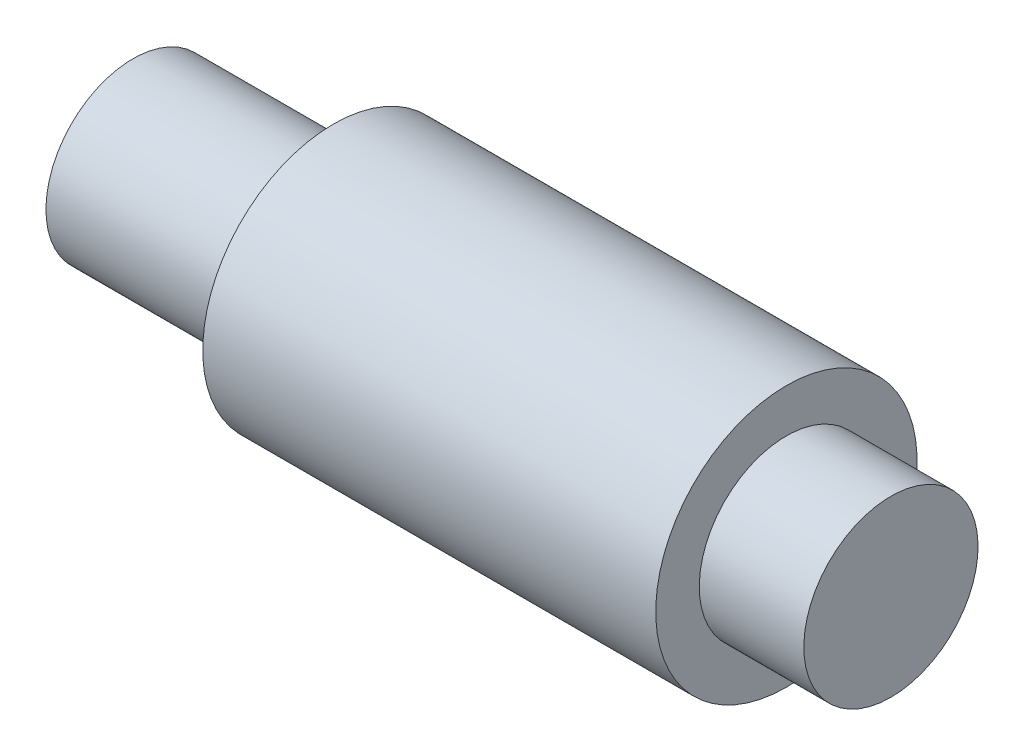
ISO-10303-21;
HEADER;
FILE_DESCRIPTION(('STEP AP214'),'2;1');
FILE_NAME('part.step','',(''),(''),'','','');
FILE_SCHEMA(('AUTOMOTIVE_DESIGN { 1 0 10303 214 1 1 1 1 }'));
ENDSEC;
DATA;
#1=APPLICATION_CONTEXT('core data for automotive mechanical design processes');
#2=APPLICATION_PROTOCOL_DEFINITION('international standard','automotive_design',2000,#1);
#3=PRODUCT_CONTEXT('',#1,'mechanical');
#4=PRODUCT('Part','Part','',(#3));
#5=PRODUCT_RELATED_PRODUCT_CATEGORY('part','',(#4));
#6=PRODUCT_DEFINITION_FORMATION('','',#4);
#7=PRODUCT_DEFINITION_CONTEXT('part definition',#1,'design');
#8=PRODUCT_DEFINITION('design','',#6,#7);
#9=PRODUCT_DEFINITION_SHAPE('','',#8);
#10=(LENGTH_UNIT() NAMED_UNIT(*) SI_UNIT(.MILLI.,.METRE.));
#11=(NAMED_UNIT(*) PLANE_ANGLE_UNIT() SI_UNIT($,.RADIAN.));
#12=(NAMED_UNIT(*) SI_UNIT($,.STERADIAN.) SOLID_ANGLE_UNIT());
#13=UNCERTAINTY_MEASURE_WITH_UNIT(LENGTH_MEASURE(1.E-05),#10,'distance_accuracy_value','');
#14=(GEOMETRIC_REPRESENTATION_CONTEXT(3) GLOBAL_UNCERTAINTY_ASSIGNED_CONTEXT((#13)) GLOBAL_UNIT_ASSIGNED_CONTEXT((#10,
#11,#12)) REPRESENTATION_CONTEXT('',''));
#15=CARTESIAN_POINT('',(0.,0.,0.));
#16=DIRECTION('',(0.,0.,1.));
#17=DIRECTION('',(1.,0.,0.));
#18=AXIS2_PLACEMENT_3D('',#15,#16,#17);
#19=CARTESIAN_POINT('',(0.,-10.,0.));
#20=DIRECTION('',(-1.,0.,0.));
#21=DIRECTION('',(0.,-1.,0.));
#22=AXIS2_PLACEMENT_3D('',#19,#20,#21);
#23=CYLINDRICAL_SURFACE('',#22,10.);
#24=CARTESIAN_POINT('',(0.,-10.,0.));
#25=DIRECTION('',(-1.,0.,0.));
#26=DIRECTION('',(0.,-1.,0.));
#27=AXIS2_PLACEMENT_3D('',#24,#25,#26);
#28=CIRCLE('',#27,10.);
#29=CARTESIAN_POINT('',(0.,-20.,0.));
#30=VERTEX_POINT('',#29);
#31=EDGE_CURVE('E10',#30,#30,#28,.T.);
#32=ORIENTED_EDGE('',*,*,#31,.F.);
#33=EDGE_LOOP('',(#32));
#34=FACE_BOUND('',#33,.T.);
#35=CARTESIAN_POINT('',(23.,-10.,0.));
#36=DIRECTION('',(-1.,0.,0.));
#37=DIRECTION('',(0.,-1.,0.));
#38=AXIS2_PLACEMENT_3D('',#35,#36,#37);
#39=CIRCLE('',#38,10.);
#40=CARTESIAN_POINT('',(23.,-20.,0.));
#41=VERTEX_POINT('',#40);
#42=EDGE_CURVE('E54',#41,#41,#39,.T.);
#43=ORIENTED_EDGE('',*,*,#42,.T.);
#44=EDGE_LOOP('',(#43));
#45=FACE_BOUND('',#44,.T.);
#46=ADVANCED_FACE('F32',(#34,#45),#23,.T.);
#47=CARTESIAN_POINT('',(0.,0.,0.));
#48=DIRECTION('',(1.,0.,0.));
#49=DIRECTION('',(0.,1.,0.));
#50=AXIS2_PLACEMENT_3D('',#47,#48,#49);
#51=PLANE('',#50);
#52=ORIENTED_EDGE('',*,*,#31,.T.);
#53=EDGE_LOOP('',(#52));
#54=FACE_BOUND('',#53,.T.);
#55=ADVANCED_FACE('F84',(#54),#51,.F.);
#56=CARTESIAN_POINT('',(87.,-10.,0.));
#57=DIRECTION('',(-1.,0.,0.));
#58=DIRECTION('',(0.,-1.,0.));
#59=AXIS2_PLACEMENT_3D('',#56,#57,#58);
#60=PLANE('',#59);
#61=CARTESIAN_POINT('',(87.,-10.,0.));
#62=DIRECTION('',(-1.,0.,0.));
#63=DIRECTION('',(0.,-1.,0.));
#64=AXIS2_PLACEMENT_3D('',#61,#62,#63);
#65=CIRCLE('',#64,10.);
#66=CARTESIAN_POINT('',(87.,-20.,0.));
#67=VERTEX_POINT('',#66);
#68=EDGE_CURVE('E38',#67,#67,#65,.T.);
#69=ORIENTED_EDGE('',*,*,#68,.F.);
#70=EDGE_LOOP('',(#69));
#71=FACE_BOUND('',#70,.T.);
#72=ADVANCED_FACE('F79',(#71),#60,.F.);
#73=CARTESIAN_POINT('',(0.,-10.,0.));
#74=DIRECTION('',(-1.,0.,0.));
#75=DIRECTION('',(0.,-1.,0.));
#76=AXIS2_PLACEMENT_3D('',#73,#74,#75);
#77=CYLINDRICAL_SURFACE('',#76,10.);
#78=CARTESIAN_POINT('',(75.,-10.,0.));
#79=DIRECTION('',(-1.,0.,0.));
#80=DIRECTION('',(0.,-1.,0.));
#81=AXIS2_PLACEMENT_3D('',#78,#79,#80);
#82=CIRCLE('',#81,10.);
#83=CARTESIAN_POINT('',(75.,-20.,0.));
#84=VERTEX_POINT('',#83);
#85=EDGE_CURVE('E42',#84,#84,#82,.T.);
#86=ORIENTED_EDGE('',*,*,#85,.F.);
#87=EDGE_LOOP('',(#86));
#88=FACE_BOUND('',#87,.T.);
#89=ORIENTED_EDGE('',*,*,#68,.T.);
#90=EDGE_LOOP('',(#89));
#91=FACE_BOUND('',#90,.T.);
#92=ADVANCED_FACE('F74',(#88,#91),#77,.T.);
#93=CARTESIAN_POINT('',(75.,0.,0.));
#94=DIRECTION('',(-1.,0.,0.));
#95=DIRECTION('',(0.,-1.,0.));
#96=AXIS2_PLACEMENT_3D('',#93,#94,#95);
#97=PLANE('',#96);
#98=CARTESIAN_POINT('',(75.,-10.,0.));
#99=DIRECTION('',(-1.,0.,0.));
#100=DIRECTION('',(0.,-1.,0.));
#101=AXIS2_PLACEMENT_3D('',#98,#99,#100);
#102=CIRCLE('',#101,15.);
#103=CARTESIAN_POINT('',(75.,-25.,0.));
#104=VERTEX_POINT('',#103);
#105=EDGE_CURVE('E46',#104,#104,#102,.T.);
#106=ORIENTED_EDGE('',*,*,#105,.F.);
#107=EDGE_LOOP('',(#106));
#108=FACE_BOUND('',#107,.T.);
#109=ORIENTED_EDGE('',*,*,#85,.T.);
#110=EDGE_LOOP('',(#109));
#111=FACE_BOUND('',#110,.T.);
#112=ADVANCED_FACE('F68',(#108,#111),#97,.F.);
#113=CARTESIAN_POINT('',(0.,-10.,0.));
#114=DIRECTION('',(-1.,0.,0.));
#115=DIRECTION('',(0.,-1.,0.));
#116=AXIS2_PLACEMENT_3D('',#113,#114,#115);
#117=CYLINDRICAL_SURFACE('',#116,15.);
#118=CARTESIAN_POINT('',(23.,-10.,0.));
#119=DIRECTION('',(-1.,0.,0.));
#120=DIRECTION('',(0.,-1.,0.));
#121=AXIS2_PLACEMENT_3D('',#118,#119,#120);
#122=CIRCLE('',#121,15.);
#123=CARTESIAN_POINT('',(23.,-25.,0.));
#124=VERTEX_POINT('',#123);
#125=EDGE_CURVE('E51',#124,#124,#122,.T.);
#126=ORIENTED_EDGE('',*,*,#125,.F.);
#127=EDGE_LOOP('',(#126));
#128=FACE_BOUND('',#127,.T.);
#129=ORIENTED_EDGE('',*,*,#105,.T.);
#130=EDGE_LOOP('',(#129));
#131=FACE_BOUND('',#130,.T.);
#132=ADVANCED_FACE('F62',(#128,#131),#117,.T.);
#133=CARTESIAN_POINT('',(23.,4.99999999999999,0.));
#134=DIRECTION('',(1.,0.,0.));
#135=DIRECTION('',(0.,1.,0.));
#136=AXIS2_PLACEMENT_3D('',#133,#134,#135);
#137=PLANE('',#136);
#138=ORIENTED_EDGE('',*,*,#42,.F.);
#139=EDGE_LOOP('',(#138));
#140=FACE_BOUND('',#139,.T.);
#141=ORIENTED_EDGE('',*,*,#125,.T.);
#142=EDGE_LOOP('',(#141));
#143=FACE_BOUND('',#142,.T.);
#144=ADVANCED_FACE('F59',(#140,#143),#137,.F.);
#145=CLOSED_SHELL('',(#46,#55,#72,#92,#112,#132,#144));
#146=MANIFOLD_SOLID_BREP('B2',#145);
#147=ADVANCED_BREP_SHAPE_REPRESENTATION('',(#18,#146),#14);
#148=SHAPE_DEFINITION_REPRESENTATION(#9,#147);
ENDSEC;
END-ISO-10303-21;
